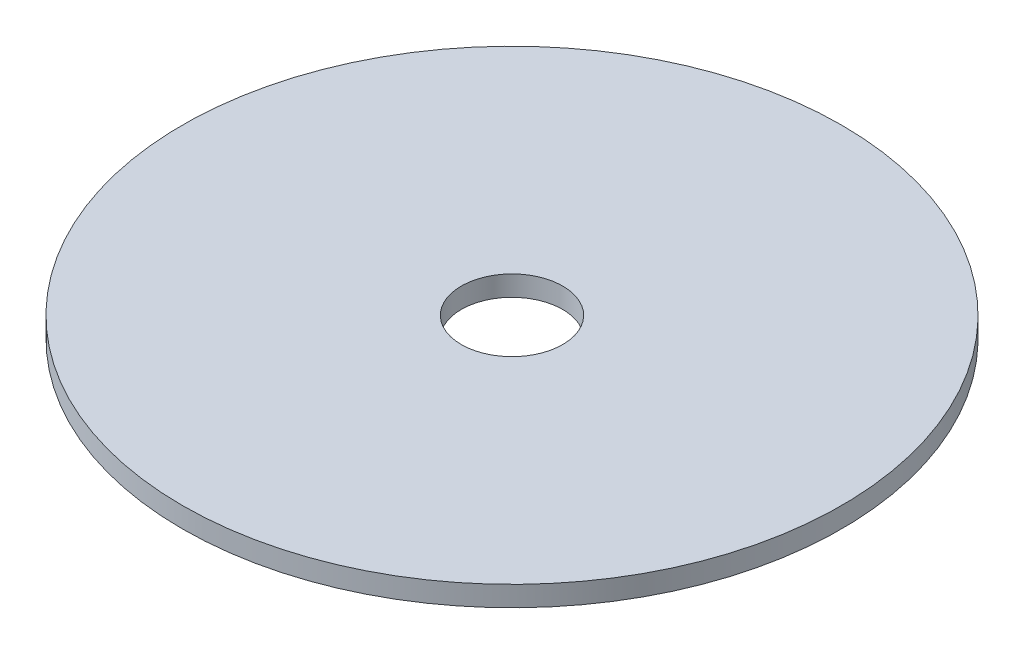
ISO-10303-21;
HEADER;
FILE_DESCRIPTION(('STEP AP214'),'2;1');
FILE_NAME('part.step','',(''),(''),'','','');
FILE_SCHEMA(('AUTOMOTIVE_DESIGN { 1 0 10303 214 1 1 1 1 }'));
ENDSEC;
DATA;
#1=APPLICATION_CONTEXT('core data for automotive mechanical design processes');
#2=APPLICATION_PROTOCOL_DEFINITION('international standard','automotive_design',2000,#1);
#3=PRODUCT_CONTEXT('',#1,'mechanical');
#4=PRODUCT('Part','Part','',(#3));
#5=PRODUCT_RELATED_PRODUCT_CATEGORY('part','',(#4));
#6=PRODUCT_DEFINITION_FORMATION('','',#4);
#7=PRODUCT_DEFINITION_CONTEXT('part definition',#1,'design');
#8=PRODUCT_DEFINITION('design','',#6,#7);
#9=PRODUCT_DEFINITION_SHAPE('','',#8);
#10=(LENGTH_UNIT() NAMED_UNIT(*) SI_UNIT(.MILLI.,.METRE.));
#11=(NAMED_UNIT(*) PLANE_ANGLE_UNIT() SI_UNIT($,.RADIAN.));
#12=(NAMED_UNIT(*) SI_UNIT($,.STERADIAN.) SOLID_ANGLE_UNIT());
#13=UNCERTAINTY_MEASURE_WITH_UNIT(LENGTH_MEASURE(1.E-05),#10,'distance_accuracy_value','');
#14=(GEOMETRIC_REPRESENTATION_CONTEXT(3) GLOBAL_UNCERTAINTY_ASSIGNED_CONTEXT((#13)) GLOBAL_UNIT_ASSIGNED_CONTEXT((#10,
#11,#12)) REPRESENTATION_CONTEXT('',''));
#15=CARTESIAN_POINT('',(0.,0.,0.));
#16=DIRECTION('',(0.,0.,1.));
#17=DIRECTION('',(1.,0.,0.));
#18=AXIS2_PLACEMENT_3D('',#15,#16,#17);
#19=CARTESIAN_POINT('',(0.,4.,0.));
#20=DIRECTION('',(0.,-1.,0.));
#21=DIRECTION('',(0.,0.,-1.));
#22=AXIS2_PLACEMENT_3D('',#19,#20,#21);
#23=CYLINDRICAL_SURFACE('',#22,65.);
#24=CARTESIAN_POINT('',(0.,4.,0.));
#25=DIRECTION('',(0.,1.,0.));
#26=DIRECTION('',(0.,0.,1.));
#27=AXIS2_PLACEMENT_3D('',#24,#25,#26);
#28=CIRCLE('',#27,65.);
#29=CARTESIAN_POINT('',(0.,4.,65.));
#30=VERTEX_POINT('',#29);
#31=EDGE_CURVE('E10',#30,#30,#28,.T.);
#32=ORIENTED_EDGE('',*,*,#31,.F.);
#33=EDGE_LOOP('',(#32));
#34=FACE_BOUND('',#33,.T.);
#35=CARTESIAN_POINT('',(0.,0.,0.));
#36=DIRECTION('',(0.,1.,0.));
#37=DIRECTION('',(0.,0.,1.));
#38=AXIS2_PLACEMENT_3D('',#35,#36,#37);
#39=CIRCLE('',#38,65.);
#40=CARTESIAN_POINT('',(0.,0.,65.));
#41=VERTEX_POINT('',#40);
#42=EDGE_CURVE('E37',#41,#41,#39,.T.);
#43=ORIENTED_EDGE('',*,*,#42,.T.);
#44=EDGE_LOOP('',(#43));
#45=FACE_BOUND('',#44,.T.);
#46=ADVANCED_FACE('F30',(#34,#45),#23,.T.);
#47=CARTESIAN_POINT('',(0.,4.,0.));
#48=DIRECTION('',(0.,1.,0.));
#49=DIRECTION('',(0.,0.,1.));
#50=AXIS2_PLACEMENT_3D('',#47,#48,#49);
#51=PLANE('',#50);
#52=CARTESIAN_POINT('',(0.,4.,0.));
#53=DIRECTION('',(0.,1.,0.));
#54=DIRECTION('',(0.,0.,1.));
#55=AXIS2_PLACEMENT_3D('',#52,#53,#54);
#56=CIRCLE('',#55,10.);
#57=CARTESIAN_POINT('',(0.,4.,10.));
#58=VERTEX_POINT('',#57);
#59=EDGE_CURVE('E43',#58,#58,#56,.T.);
#60=ORIENTED_EDGE('',*,*,#59,.F.);
#61=EDGE_LOOP('',(#60));
#62=FACE_BOUND('',#61,.T.);
#63=ORIENTED_EDGE('',*,*,#31,.T.);
#64=EDGE_LOOP('',(#63));
#65=FACE_BOUND('',#64,.T.);
#66=ADVANCED_FACE('F60',(#62,#65),#51,.T.);
#67=CARTESIAN_POINT('',(0.,0.,0.));
#68=DIRECTION('',(0.,1.,0.));
#69=DIRECTION('',(0.,0.,1.));
#70=AXIS2_PLACEMENT_3D('',#67,#68,#69);
#71=PLANE('',#70);
#72=CARTESIAN_POINT('',(0.,0.,0.));
#73=DIRECTION('',(0.,1.,0.));
#74=DIRECTION('',(0.,0.,1.));
#75=AXIS2_PLACEMENT_3D('',#72,#73,#74);
#76=CIRCLE('',#75,10.);
#77=CARTESIAN_POINT('',(0.,0.,10.));
#78=VERTEX_POINT('',#77);
#79=EDGE_CURVE('E33',#78,#78,#76,.T.);
#80=ORIENTED_EDGE('',*,*,#79,.T.);
#81=EDGE_LOOP('',(#80));
#82=FACE_BOUND('',#81,.T.);
#83=ORIENTED_EDGE('',*,*,#42,.F.);
#84=EDGE_LOOP('',(#83));
#85=FACE_BOUND('',#84,.T.);
#86=ADVANCED_FACE('F50',(#82,#85),#71,.F.);
#87=CARTESIAN_POINT('',(0.,-6.,0.));
#88=DIRECTION('',(0.,1.,0.));
#89=DIRECTION('',(0.,0.,1.));
#90=AXIS2_PLACEMENT_3D('',#87,#88,#89);
#91=CYLINDRICAL_SURFACE('',#90,10.);
#92=ORIENTED_EDGE('',*,*,#59,.T.);
#93=EDGE_LOOP('',(#92));
#94=FACE_BOUND('',#93,.T.);
#95=ORIENTED_EDGE('',*,*,#79,.F.);
#96=EDGE_LOOP('',(#95));
#97=FACE_BOUND('',#96,.T.);
#98=ADVANCED_FACE('F53',(#94,#97),#91,.F.);
#99=CLOSED_SHELL('',(#46,#66,#86,#98));
#100=MANIFOLD_SOLID_BREP('B2',#99);
#101=ADVANCED_BREP_SHAPE_REPRESENTATION('',(#18,#100),#14);
#102=SHAPE_DEFINITION_REPRESENTATION(#9,#101);
ENDSEC;
END-ISO-10303-21;
